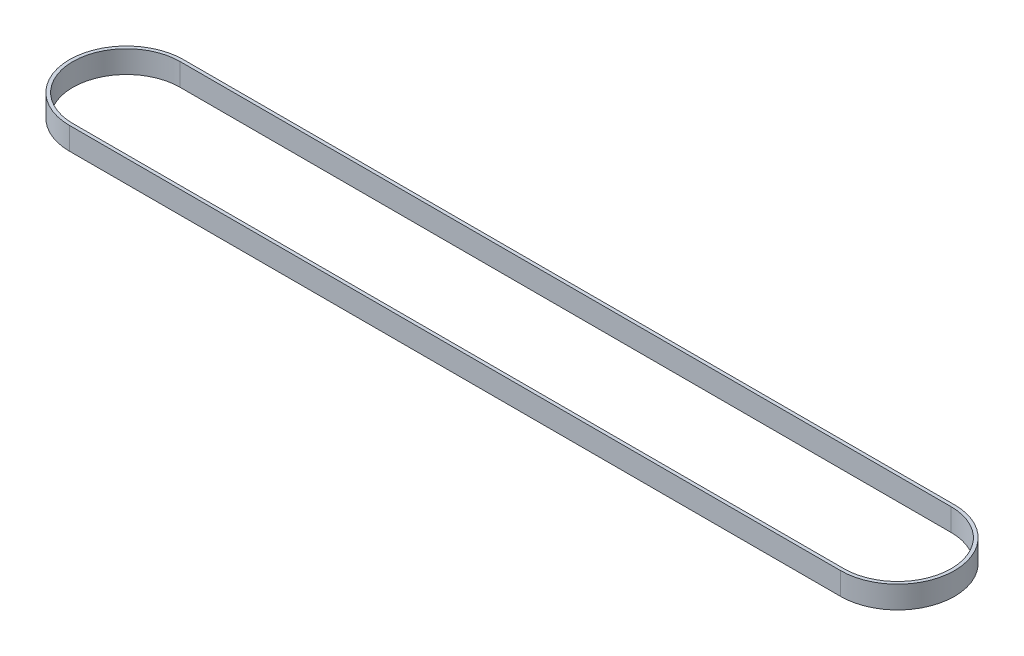
ISO-10303-21;
HEADER;
FILE_DESCRIPTION(('STEP AP214'),'2;1');
FILE_NAME('part.step','',(''),(''),'','','');
FILE_SCHEMA(('AUTOMOTIVE_DESIGN { 1 0 10303 214 1 1 1 1 }'));
ENDSEC;
DATA;
#1=APPLICATION_CONTEXT('core data for automotive mechanical design processes');
#2=APPLICATION_PROTOCOL_DEFINITION('international standard','automotive_design',2000,#1);
#3=PRODUCT_CONTEXT('',#1,'mechanical');
#4=PRODUCT('Part','Part','',(#3));
#5=PRODUCT_RELATED_PRODUCT_CATEGORY('part','',(#4));
#6=PRODUCT_DEFINITION_FORMATION('','',#4);
#7=PRODUCT_DEFINITION_CONTEXT('part definition',#1,'design');
#8=PRODUCT_DEFINITION('design','',#6,#7);
#9=PRODUCT_DEFINITION_SHAPE('','',#8);
#10=(LENGTH_UNIT() NAMED_UNIT(*) SI_UNIT(.MILLI.,.METRE.));
#11=(NAMED_UNIT(*) PLANE_ANGLE_UNIT() SI_UNIT($,.RADIAN.));
#12=(NAMED_UNIT(*) SI_UNIT($,.STERADIAN.) SOLID_ANGLE_UNIT());
#13=UNCERTAINTY_MEASURE_WITH_UNIT(LENGTH_MEASURE(1.E-05),#10,'distance_accuracy_value','');
#14=(GEOMETRIC_REPRESENTATION_CONTEXT(3) GLOBAL_UNCERTAINTY_ASSIGNED_CONTEXT((#13)) GLOBAL_UNIT_ASSIGNED_CONTEXT((#10,
#11,#12)) REPRESENTATION_CONTEXT('',''));
#15=CARTESIAN_POINT('',(0.,0.,0.));
#16=DIRECTION('',(0.,0.,1.));
#17=DIRECTION('',(1.,0.,0.));
#18=AXIS2_PLACEMENT_3D('',#15,#16,#17);
#19=CARTESIAN_POINT('',(-115.321505596151,10.,0.));
#20=DIRECTION('',(0.,1.,0.));
#21=DIRECTION('',(0.,0.,1.));
#22=AXIS2_PLACEMENT_3D('',#19,#20,#21);
#23=PLANE('',#22);
#24=CARTESIAN_POINT('',(-115.321505596151,10.,0.));
#25=DIRECTION('',(0.,1.,0.));
#26=DIRECTION('',(0.,0.,1.));
#27=AXIS2_PLACEMENT_3D('',#24,#25,#26);
#28=CIRCLE('',#27,25.5);
#29=CARTESIAN_POINT('',(-115.321505596151,10.,-25.5));
#30=VERTEX_POINT('',#29);
#31=CARTESIAN_POINT('',(-115.321505596151,10.,25.5));
#32=VERTEX_POINT('',#31);
#33=EDGE_CURVE('E153',#30,#32,#28,.T.);
#34=ORIENTED_EDGE('',*,*,#33,.T.);
#35=DIRECTION('',(1.,0.,0.));
#36=VECTOR('',#35,1.);
#37=CARTESIAN_POINT('',(-115.321505596151,10.,25.5));
#38=LINE('',#37,#36);
#39=CARTESIAN_POINT('',(229.678494403849,10.,25.5));
#40=VERTEX_POINT('',#39);
#41=EDGE_CURVE('E157',#32,#40,#38,.T.);
#42=ORIENTED_EDGE('',*,*,#41,.T.);
#43=CARTESIAN_POINT('',(229.678494403849,10.,0.));
#44=DIRECTION('',(0.,1.,0.));
#45=DIRECTION('',(0.,0.,1.));
#46=AXIS2_PLACEMENT_3D('',#43,#44,#45);
#47=CIRCLE('',#46,25.5);
#48=CARTESIAN_POINT('',(229.678494403849,10.,-25.5));
#49=VERTEX_POINT('',#48);
#50=EDGE_CURVE('E161',#40,#49,#47,.T.);
#51=ORIENTED_EDGE('',*,*,#50,.T.);
#52=DIRECTION('',(-1.,0.,0.));
#53=VECTOR('',#52,1.);
#54=CARTESIAN_POINT('',(-115.321505596151,10.,-25.5));
#55=LINE('',#54,#53);
#56=EDGE_CURVE('E164',#49,#30,#55,.T.);
#57=ORIENTED_EDGE('',*,*,#56,.T.);
#58=EDGE_LOOP('',(#34,#42,#51,#57));
#59=FACE_BOUND('',#58,.T.);
#60=DIRECTION('',(1.,0.,0.));
#61=VECTOR('',#60,1.);
#62=CARTESIAN_POINT('',(-115.321505596151,10.,24.));
#63=LINE('',#62,#61);
#64=CARTESIAN_POINT('',(-115.321505596151,10.,24.));
#65=VERTEX_POINT('',#64);
#66=CARTESIAN_POINT('',(229.678494403849,10.,24.));
#67=VERTEX_POINT('',#66);
#68=EDGE_CURVE('E114',#65,#67,#63,.T.);
#69=ORIENTED_EDGE('',*,*,#68,.F.);
#70=CARTESIAN_POINT('',(-115.321505596151,10.,0.));
#71=DIRECTION('',(0.,1.,0.));
#72=DIRECTION('',(0.,0.,1.));
#73=AXIS2_PLACEMENT_3D('',#70,#71,#72);
#74=CIRCLE('',#73,24.);
#75=CARTESIAN_POINT('',(-115.321505596151,10.,-24.));
#76=VERTEX_POINT('',#75);
#77=EDGE_CURVE('E105',#76,#65,#74,.T.);
#78=ORIENTED_EDGE('',*,*,#77,.F.);
#79=DIRECTION('',(-1.,0.,0.));
#80=VECTOR('',#79,1.);
#81=CARTESIAN_POINT('',(-115.321505596151,10.,-24.));
#82=LINE('',#81,#80);
#83=CARTESIAN_POINT('',(229.678494403849,10.,-24.));
#84=VERTEX_POINT('',#83);
#85=EDGE_CURVE('E131',#84,#76,#82,.T.);
#86=ORIENTED_EDGE('',*,*,#85,.F.);
#87=CARTESIAN_POINT('',(229.678494403849,10.,0.));
#88=DIRECTION('',(0.,1.,0.));
#89=DIRECTION('',(0.,0.,1.));
#90=AXIS2_PLACEMENT_3D('',#87,#88,#89);
#91=CIRCLE('',#90,24.);
#92=EDGE_CURVE('E127',#67,#84,#91,.T.);
#93=ORIENTED_EDGE('',*,*,#92,.F.);
#94=EDGE_LOOP('',(#69,#78,#86,#93));
#95=FACE_BOUND('',#94,.T.);
#96=ADVANCED_FACE('F39',(#59,#95),#23,.T.);
#97=CARTESIAN_POINT('',(-115.321505596151,0.,0.));
#98=DIRECTION('',(0.,1.,0.));
#99=DIRECTION('',(0.,0.,1.));
#100=AXIS2_PLACEMENT_3D('',#97,#98,#99);
#101=PLANE('',#100);
#102=CARTESIAN_POINT('',(-115.321505596151,0.,0.));
#103=DIRECTION('',(0.,1.,0.));
#104=DIRECTION('',(0.,0.,1.));
#105=AXIS2_PLACEMENT_3D('',#102,#103,#104);
#106=CIRCLE('',#105,25.5);
#107=CARTESIAN_POINT('',(-115.321505596151,0.,-25.5));
#108=VERTEX_POINT('',#107);
#109=CARTESIAN_POINT('',(-115.321505596151,0.,25.5));
#110=VERTEX_POINT('',#109);
#111=EDGE_CURVE('E123',#108,#110,#106,.T.);
#112=ORIENTED_EDGE('',*,*,#111,.F.);
#113=DIRECTION('',(-1.,0.,0.));
#114=VECTOR('',#113,1.);
#115=CARTESIAN_POINT('',(-115.321505596151,0.,-25.5));
#116=LINE('',#115,#114);
#117=CARTESIAN_POINT('',(229.678494403849,0.,-25.5));
#118=VERTEX_POINT('',#117);
#119=EDGE_CURVE('E158',#118,#108,#116,.T.);
#120=ORIENTED_EDGE('',*,*,#119,.F.);
#121=CARTESIAN_POINT('',(229.678494403849,0.,0.));
#122=DIRECTION('',(0.,1.,0.));
#123=DIRECTION('',(0.,0.,1.));
#124=AXIS2_PLACEMENT_3D('',#121,#122,#123);
#125=CIRCLE('',#124,25.5);
#126=CARTESIAN_POINT('',(229.678494403849,0.,25.5));
#127=VERTEX_POINT('',#126);
#128=EDGE_CURVE('E174',#127,#118,#125,.T.);
#129=ORIENTED_EDGE('',*,*,#128,.F.);
#130=DIRECTION('',(1.,0.,0.));
#131=VECTOR('',#130,1.);
#132=CARTESIAN_POINT('',(-115.321505596151,0.,25.5));
#133=LINE('',#132,#131);
#134=EDGE_CURVE('E171',#110,#127,#133,.T.);
#135=ORIENTED_EDGE('',*,*,#134,.F.);
#136=EDGE_LOOP('',(#112,#120,#129,#135));
#137=FACE_BOUND('',#136,.T.);
#138=CARTESIAN_POINT('',(-115.321505596151,0.,0.));
#139=DIRECTION('',(0.,1.,0.));
#140=DIRECTION('',(0.,0.,1.));
#141=AXIS2_PLACEMENT_3D('',#138,#139,#140);
#142=CIRCLE('',#141,24.);
#143=CARTESIAN_POINT('',(-115.321505596151,0.,-24.));
#144=VERTEX_POINT('',#143);
#145=CARTESIAN_POINT('',(-115.321505596151,0.,24.));
#146=VERTEX_POINT('',#145);
#147=EDGE_CURVE('E63',#144,#146,#142,.T.);
#148=ORIENTED_EDGE('',*,*,#147,.T.);
#149=DIRECTION('',(1.,0.,0.));
#150=VECTOR('',#149,1.);
#151=CARTESIAN_POINT('',(-115.321505596151,0.,24.));
#152=LINE('',#151,#150);
#153=CARTESIAN_POINT('',(229.678494403849,0.,24.));
#154=VERTEX_POINT('',#153);
#155=EDGE_CURVE('E121',#146,#154,#152,.T.);
#156=ORIENTED_EDGE('',*,*,#155,.T.);
#157=CARTESIAN_POINT('',(229.678494403849,0.,0.));
#158=DIRECTION('',(0.,1.,0.));
#159=DIRECTION('',(0.,0.,1.));
#160=AXIS2_PLACEMENT_3D('',#157,#158,#159);
#161=CIRCLE('',#160,24.);
#162=CARTESIAN_POINT('',(229.678494403849,0.,-24.));
#163=VERTEX_POINT('',#162);
#164=EDGE_CURVE('E140',#154,#163,#161,.T.);
#165=ORIENTED_EDGE('',*,*,#164,.T.);
#166=DIRECTION('',(-1.,0.,0.));
#167=VECTOR('',#166,1.);
#168=CARTESIAN_POINT('',(-115.321505596151,0.,-24.));
#169=LINE('',#168,#167);
#170=EDGE_CURVE('E115',#163,#144,#169,.T.);
#171=ORIENTED_EDGE('',*,*,#170,.T.);
#172=EDGE_LOOP('',(#148,#156,#165,#171));
#173=FACE_BOUND('',#172,.T.);
#174=ADVANCED_FACE('F197',(#137,#173),#101,.F.);
#175=CARTESIAN_POINT('',(-115.321505596151,10.,0.));
#176=DIRECTION('',(0.,-1.,0.));
#177=DIRECTION('',(0.,0.,-1.));
#178=AXIS2_PLACEMENT_3D('',#175,#176,#177);
#179=CYLINDRICAL_SURFACE('',#178,25.5);
#180=ORIENTED_EDGE('',*,*,#111,.T.);
#181=DIRECTION('',(0.,-1.,0.));
#182=VECTOR('',#181,1.);
#183=CARTESIAN_POINT('',(-115.321505596151,10.,25.5));
#184=LINE('',#183,#182);
#185=EDGE_CURVE('E11',#32,#110,#184,.T.);
#186=ORIENTED_EDGE('',*,*,#185,.F.);
#187=ORIENTED_EDGE('',*,*,#33,.F.);
#188=DIRECTION('',(0.,-1.,0.));
#189=VECTOR('',#188,1.);
#190=CARTESIAN_POINT('',(-115.321505596151,10.,-25.5));
#191=LINE('',#190,#189);
#192=EDGE_CURVE('E167',#30,#108,#191,.T.);
#193=ORIENTED_EDGE('',*,*,#192,.T.);
#194=EDGE_LOOP('',(#180,#186,#187,#193));
#195=FACE_BOUND('',#194,.T.);
#196=ADVANCED_FACE('F41',(#195),#179,.T.);
#197=CARTESIAN_POINT('',(-115.321505596151,10.,25.5));
#198=DIRECTION('',(0.,0.,-1.));
#199=DIRECTION('',(-1.,0.,0.));
#200=AXIS2_PLACEMENT_3D('',#197,#198,#199);
#201=PLANE('',#200);
#202=ORIENTED_EDGE('',*,*,#134,.T.);
#203=DIRECTION('',(0.,-1.,0.));
#204=VECTOR('',#203,1.);
#205=CARTESIAN_POINT('',(229.678494403849,10.,25.5));
#206=LINE('',#205,#204);
#207=EDGE_CURVE('E48',#40,#127,#206,.T.);
#208=ORIENTED_EDGE('',*,*,#207,.F.);
#209=ORIENTED_EDGE('',*,*,#41,.F.);
#210=ORIENTED_EDGE('',*,*,#185,.T.);
#211=EDGE_LOOP('',(#202,#208,#209,#210));
#212=FACE_BOUND('',#211,.T.);
#213=ADVANCED_FACE('F207',(#212),#201,.F.);
#214=CARTESIAN_POINT('',(229.678494403849,10.,0.));
#215=DIRECTION('',(0.,-1.,0.));
#216=DIRECTION('',(0.,0.,-1.));
#217=AXIS2_PLACEMENT_3D('',#214,#215,#216);
#218=CYLINDRICAL_SURFACE('',#217,25.5);
#219=ORIENTED_EDGE('',*,*,#128,.T.);
#220=DIRECTION('',(0.,-1.,0.));
#221=VECTOR('',#220,1.);
#222=CARTESIAN_POINT('',(229.678494403849,10.,-25.5));
#223=LINE('',#222,#221);
#224=EDGE_CURVE('E182',#49,#118,#223,.T.);
#225=ORIENTED_EDGE('',*,*,#224,.F.);
#226=ORIENTED_EDGE('',*,*,#50,.F.);
#227=ORIENTED_EDGE('',*,*,#207,.T.);
#228=EDGE_LOOP('',(#219,#225,#226,#227));
#229=FACE_BOUND('',#228,.T.);
#230=ADVANCED_FACE('F191',(#229),#218,.T.);
#231=CARTESIAN_POINT('',(-115.321505596151,10.,-25.5));
#232=DIRECTION('',(0.,0.,1.));
#233=DIRECTION('',(1.,0.,0.));
#234=AXIS2_PLACEMENT_3D('',#231,#232,#233);
#235=PLANE('',#234);
#236=ORIENTED_EDGE('',*,*,#119,.T.);
#237=ORIENTED_EDGE('',*,*,#192,.F.);
#238=ORIENTED_EDGE('',*,*,#56,.F.);
#239=ORIENTED_EDGE('',*,*,#224,.T.);
#240=EDGE_LOOP('',(#236,#237,#238,#239));
#241=FACE_BOUND('',#240,.T.);
#242=ADVANCED_FACE('F201',(#241),#235,.F.);
#243=CARTESIAN_POINT('',(-115.321505596151,10.,0.));
#244=DIRECTION('',(0.,-1.,0.));
#245=DIRECTION('',(0.,0.,-1.));
#246=AXIS2_PLACEMENT_3D('',#243,#244,#245);
#247=CYLINDRICAL_SURFACE('',#246,24.);
#248=ORIENTED_EDGE('',*,*,#147,.F.);
#249=DIRECTION('',(0.,-1.,0.));
#250=VECTOR('',#249,1.);
#251=CARTESIAN_POINT('',(-115.321505596151,10.,-24.));
#252=LINE('',#251,#250);
#253=EDGE_CURVE('E109',#76,#144,#252,.T.);
#254=ORIENTED_EDGE('',*,*,#253,.F.);
#255=ORIENTED_EDGE('',*,*,#77,.T.);
#256=DIRECTION('',(0.,-1.,0.));
#257=VECTOR('',#256,1.);
#258=CARTESIAN_POINT('',(-115.321505596151,10.,24.));
#259=LINE('',#258,#257);
#260=EDGE_CURVE('E108',#65,#146,#259,.T.);
#261=ORIENTED_EDGE('',*,*,#260,.T.);
#262=EDGE_LOOP('',(#248,#254,#255,#261));
#263=FACE_BOUND('',#262,.T.);
#264=ADVANCED_FACE('F107',(#263),#247,.F.);
#265=CARTESIAN_POINT('',(-115.321505596151,10.,24.));
#266=DIRECTION('',(0.,0.,-1.));
#267=DIRECTION('',(-1.,0.,0.));
#268=AXIS2_PLACEMENT_3D('',#265,#266,#267);
#269=PLANE('',#268);
#270=ORIENTED_EDGE('',*,*,#155,.F.);
#271=ORIENTED_EDGE('',*,*,#260,.F.);
#272=ORIENTED_EDGE('',*,*,#68,.T.);
#273=DIRECTION('',(0.,-1.,0.));
#274=VECTOR('',#273,1.);
#275=CARTESIAN_POINT('',(229.678494403849,10.,24.));
#276=LINE('',#275,#274);
#277=EDGE_CURVE('E124',#67,#154,#276,.T.);
#278=ORIENTED_EDGE('',*,*,#277,.T.);
#279=EDGE_LOOP('',(#270,#271,#272,#278));
#280=FACE_BOUND('',#279,.T.);
#281=ADVANCED_FACE('F118',(#280),#269,.T.);
#282=CARTESIAN_POINT('',(229.678494403849,10.,0.));
#283=DIRECTION('',(0.,-1.,0.));
#284=DIRECTION('',(0.,0.,-1.));
#285=AXIS2_PLACEMENT_3D('',#282,#283,#284);
#286=CYLINDRICAL_SURFACE('',#285,24.);
#287=ORIENTED_EDGE('',*,*,#164,.F.);
#288=ORIENTED_EDGE('',*,*,#277,.F.);
#289=ORIENTED_EDGE('',*,*,#92,.T.);
#290=DIRECTION('',(0.,-1.,0.));
#291=VECTOR('',#290,1.);
#292=CARTESIAN_POINT('',(229.678494403849,10.,-24.));
#293=LINE('',#292,#291);
#294=EDGE_CURVE('E55',#84,#163,#293,.T.);
#295=ORIENTED_EDGE('',*,*,#294,.T.);
#296=EDGE_LOOP('',(#287,#288,#289,#295));
#297=FACE_BOUND('',#296,.T.);
#298=ADVANCED_FACE('F230',(#297),#286,.F.);
#299=CARTESIAN_POINT('',(-115.321505596151,10.,-24.));
#300=DIRECTION('',(0.,0.,1.));
#301=DIRECTION('',(1.,0.,0.));
#302=AXIS2_PLACEMENT_3D('',#299,#300,#301);
#303=PLANE('',#302);
#304=ORIENTED_EDGE('',*,*,#170,.F.);
#305=ORIENTED_EDGE('',*,*,#294,.F.);
#306=ORIENTED_EDGE('',*,*,#85,.T.);
#307=ORIENTED_EDGE('',*,*,#253,.T.);
#308=EDGE_LOOP('',(#304,#305,#306,#307));
#309=FACE_BOUND('',#308,.T.);
#310=ADVANCED_FACE('F234',(#309),#303,.T.);
#311=CLOSED_SHELL('',(#96,#174,#196,#213,#230,#242,#264,#281,#298,#310));
#312=MANIFOLD_SOLID_BREP('B2',#311);
#313=ADVANCED_BREP_SHAPE_REPRESENTATION('',(#18,#312),#14);
#314=SHAPE_DEFINITION_REPRESENTATION(#9,#313);
ENDSEC;
END-ISO-10303-21;
